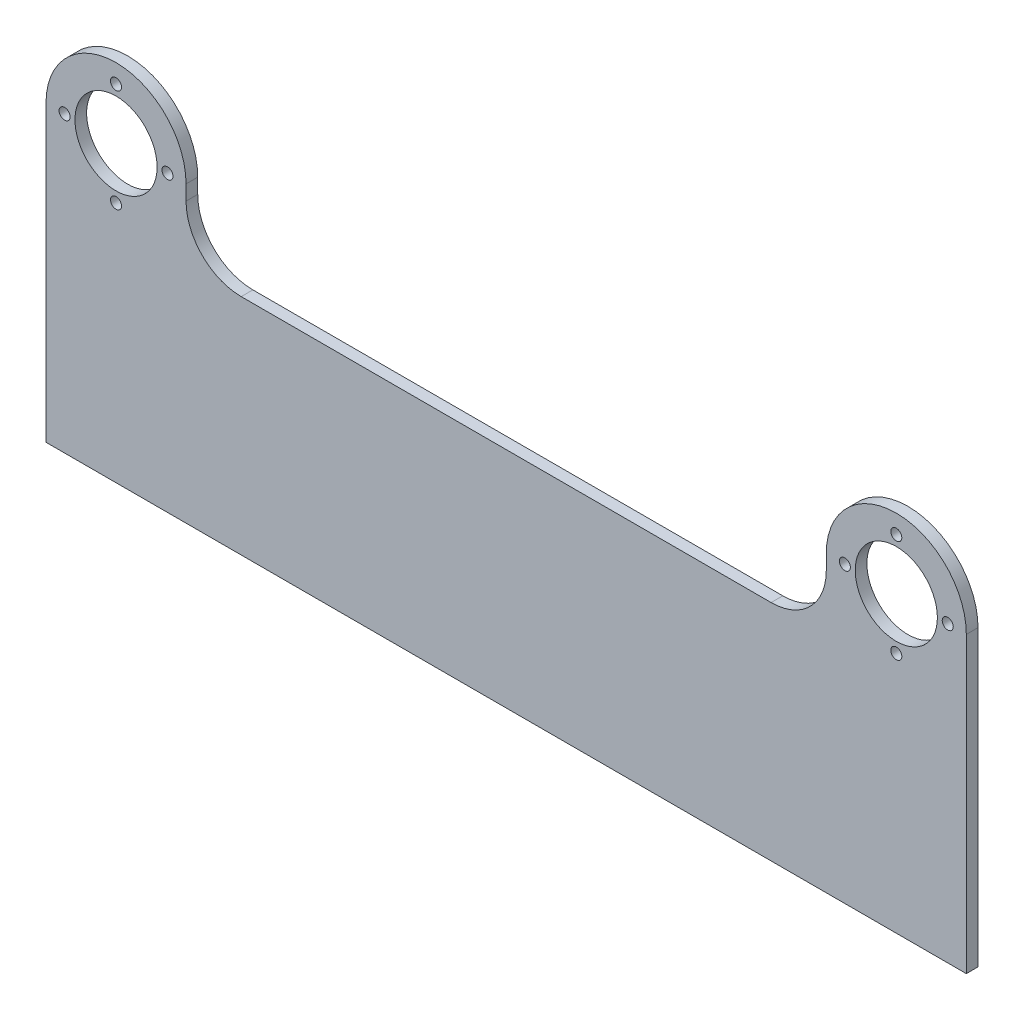
ISO-10303-21;
HEADER;
FILE_DESCRIPTION(('STEP AP214'),'2;1');
FILE_NAME('part.step','',(''),(''),'','','');
FILE_SCHEMA(('AUTOMOTIVE_DESIGN { 1 0 10303 214 1 1 1 1 }'));
ENDSEC;
DATA;
#1=APPLICATION_CONTEXT('core data for automotive mechanical design processes');
#2=APPLICATION_PROTOCOL_DEFINITION('international standard','automotive_design',2000,#1);
#3=PRODUCT_CONTEXT('',#1,'mechanical');
#4=PRODUCT('Part','Part','',(#3));
#5=PRODUCT_RELATED_PRODUCT_CATEGORY('part','',(#4));
#6=PRODUCT_DEFINITION_FORMATION('','',#4);
#7=PRODUCT_DEFINITION_CONTEXT('part definition',#1,'design');
#8=PRODUCT_DEFINITION('design','',#6,#7);
#9=PRODUCT_DEFINITION_SHAPE('','',#8);
#10=(LENGTH_UNIT() NAMED_UNIT(*) SI_UNIT(.MILLI.,.METRE.));
#11=(NAMED_UNIT(*) PLANE_ANGLE_UNIT() SI_UNIT($,.RADIAN.));
#12=(NAMED_UNIT(*) SI_UNIT($,.STERADIAN.) SOLID_ANGLE_UNIT());
#13=UNCERTAINTY_MEASURE_WITH_UNIT(LENGTH_MEASURE(1.E-05),#10,'distance_accuracy_value','');
#14=(GEOMETRIC_REPRESENTATION_CONTEXT(3) GLOBAL_UNCERTAINTY_ASSIGNED_CONTEXT((#13)) GLOBAL_UNIT_ASSIGNED_CONTEXT((#10,
#11,#12)) REPRESENTATION_CONTEXT('',''));
#15=CARTESIAN_POINT('',(0.,0.,0.));
#16=DIRECTION('',(0.,0.,1.));
#17=DIRECTION('',(1.,0.,0.));
#18=AXIS2_PLACEMENT_3D('',#15,#16,#17);
#19=CARTESIAN_POINT('',(178.2,-4.05,3.175));
#20=DIRECTION('',(0.,0.,-1.));
#21=DIRECTION('',(-1.,0.,0.));
#22=AXIS2_PLACEMENT_3D('',#19,#20,#21);
#23=PLANE('',#22);
#24=CARTESIAN_POINT('',(178.2,-4.05,3.175));
#25=DIRECTION('',(0.,0.,-1.));
#26=DIRECTION('',(-1.,0.,0.));
#27=AXIS2_PLACEMENT_3D('',#24,#25,#26);
#28=CIRCLE('',#27,15.);
#29=CARTESIAN_POINT('',(193.2,-4.0499999999999,3.175));
#30=VERTEX_POINT('',#29);
#31=CARTESIAN_POINT('',(178.2,-19.05,3.175));
#32=VERTEX_POINT('',#31);
#33=EDGE_CURVE('E183',#30,#32,#28,.T.);
#34=ORIENTED_EDGE('',*,*,#33,.T.);
#35=DIRECTION('',(-1.,0.,0.));
#36=VECTOR('',#35,1.);
#37=CARTESIAN_POINT('',(34.0500000000001,-19.05,3.175));
#38=LINE('',#37,#36);
#39=CARTESIAN_POINT('',(34.0500000000001,-19.05,3.175));
#40=VERTEX_POINT('',#39);
#41=EDGE_CURVE('E106',#32,#40,#38,.T.);
#42=ORIENTED_EDGE('',*,*,#41,.T.);
#43=CARTESIAN_POINT('',(34.05,-4.05,3.175));
#44=DIRECTION('',(0.,0.,-1.));
#45=DIRECTION('',(1.,0.,0.));
#46=AXIS2_PLACEMENT_3D('',#43,#44,#45);
#47=CIRCLE('',#46,15.);
#48=CARTESIAN_POINT('',(19.05,-4.0499999999999,3.175));
#49=VERTEX_POINT('',#48);
#50=EDGE_CURVE('E212',#40,#49,#47,.T.);
#51=ORIENTED_EDGE('',*,*,#50,.T.);
#52=DIRECTION('',(0.,1.,0.));
#53=VECTOR('',#52,1.);
#54=CARTESIAN_POINT('',(19.05,0.,3.175));
#55=LINE('',#54,#53);
#56=CARTESIAN_POINT('',(19.05,0.,3.175));
#57=VERTEX_POINT('',#56);
#58=EDGE_CURVE('E231',#49,#57,#55,.T.);
#59=ORIENTED_EDGE('',*,*,#58,.T.);
#60=CARTESIAN_POINT('',(0.,0.,3.175));
#61=DIRECTION('',(0.,0.,1.));
#62=DIRECTION('',(1.,0.,0.));
#63=AXIS2_PLACEMENT_3D('',#60,#61,#62);
#64=CIRCLE('',#63,19.05);
#65=CARTESIAN_POINT('',(-19.05,0.,3.175));
#66=VERTEX_POINT('',#65);
#67=EDGE_CURVE('E227',#57,#66,#64,.T.);
#68=ORIENTED_EDGE('',*,*,#67,.T.);
#69=DIRECTION('',(0.,-1.,0.));
#70=VECTOR('',#69,1.);
#71=CARTESIAN_POINT('',(-19.05,-19.05,3.175));
#72=LINE('',#71,#70);
#73=CARTESIAN_POINT('',(-19.05,-79.925453531839,3.175));
#74=VERTEX_POINT('',#73);
#75=EDGE_CURVE('E230',#66,#74,#72,.T.);
#76=ORIENTED_EDGE('',*,*,#75,.T.);
#77=DIRECTION('',(1.,0.,0.));
#78=VECTOR('',#77,1.);
#79=CARTESIAN_POINT('',(-19.05,-79.925453531839,3.175));
#80=LINE('',#79,#78);
#81=CARTESIAN_POINT('',(231.3,-79.925453531839,3.175));
#82=VERTEX_POINT('',#81);
#83=EDGE_CURVE('E131',#74,#82,#80,.T.);
#84=ORIENTED_EDGE('',*,*,#83,.T.);
#85=DIRECTION('',(0.,1.,0.));
#86=VECTOR('',#85,1.);
#87=CARTESIAN_POINT('',(231.3,-19.05,3.175));
#88=LINE('',#87,#86);
#89=CARTESIAN_POINT('',(231.3,0.,3.175));
#90=VERTEX_POINT('',#89);
#91=EDGE_CURVE('E125',#82,#90,#88,.T.);
#92=ORIENTED_EDGE('',*,*,#91,.T.);
#93=CARTESIAN_POINT('',(212.25,0.,3.175));
#94=DIRECTION('',(0.,0.,1.));
#95=DIRECTION('',(1.,0.,0.));
#96=AXIS2_PLACEMENT_3D('',#93,#94,#95);
#97=CIRCLE('',#96,19.05);
#98=CARTESIAN_POINT('',(193.2,0.,3.175));
#99=VERTEX_POINT('',#98);
#100=EDGE_CURVE('E129',#90,#99,#97,.T.);
#101=ORIENTED_EDGE('',*,*,#100,.T.);
#102=DIRECTION('',(0.,-1.,0.));
#103=VECTOR('',#102,1.);
#104=CARTESIAN_POINT('',(193.2,0.,3.175));
#105=LINE('',#104,#103);
#106=EDGE_CURVE('E57',#99,#30,#105,.T.);
#107=ORIENTED_EDGE('',*,*,#106,.T.);
#108=EDGE_LOOP('',(#34,#42,#51,#59,#68,#76,#84,#92,#101,#107));
#109=FACE_BOUND('',#108,.T.);
#110=CARTESIAN_POINT('',(0.,0.,3.175));
#111=DIRECTION('',(0.,0.,1.));
#112=DIRECTION('',(1.,0.,0.));
#113=AXIS2_PLACEMENT_3D('',#110,#111,#112);
#114=CIRCLE('',#113,11.176);
#115=CARTESIAN_POINT('',(11.176,0.,3.175));
#116=VERTEX_POINT('',#115);
#117=EDGE_CURVE('E157',#116,#116,#114,.T.);
#118=ORIENTED_EDGE('',*,*,#117,.F.);
#119=EDGE_LOOP('',(#118));
#120=FACE_BOUND('',#119,.T.);
#121=CARTESIAN_POINT('',(212.25,0.,3.175));
#122=DIRECTION('',(0.,0.,1.));
#123=DIRECTION('',(1.,0.,0.));
#124=AXIS2_PLACEMENT_3D('',#121,#122,#123);
#125=CIRCLE('',#124,11.176);
#126=CARTESIAN_POINT('',(223.426,0.,3.175));
#127=VERTEX_POINT('',#126);
#128=EDGE_CURVE('E249',#127,#127,#125,.T.);
#129=ORIENTED_EDGE('',*,*,#128,.F.);
#130=EDGE_LOOP('',(#129));
#131=FACE_BOUND('',#130,.T.);
#132=CARTESIAN_POINT('',(0.,13.9954,3.175));
#133=DIRECTION('',(0.,0.,1.));
#134=DIRECTION('',(1.,0.,0.));
#135=AXIS2_PLACEMENT_3D('',#132,#133,#134);
#136=CIRCLE('',#135,1.5);
#137=CARTESIAN_POINT('',(1.5,13.9954,3.175));
#138=VERTEX_POINT('',#137);
#139=EDGE_CURVE('E257',#138,#138,#136,.T.);
#140=ORIENTED_EDGE('',*,*,#139,.F.);
#141=EDGE_LOOP('',(#140));
#142=FACE_BOUND('',#141,.T.);
#143=CARTESIAN_POINT('',(212.25,13.9954,3.175));
#144=DIRECTION('',(0.,0.,1.));
#145=DIRECTION('',(1.,0.,0.));
#146=AXIS2_PLACEMENT_3D('',#143,#144,#145);
#147=CIRCLE('',#146,1.5);
#148=CARTESIAN_POINT('',(213.75,13.9954,3.175));
#149=VERTEX_POINT('',#148);
#150=EDGE_CURVE('E265',#149,#149,#147,.T.);
#151=ORIENTED_EDGE('',*,*,#150,.F.);
#152=EDGE_LOOP('',(#151));
#153=FACE_BOUND('',#152,.T.);
#154=CARTESIAN_POINT('',(13.9954,0.,3.175));
#155=DIRECTION('',(0.,0.,1.));
#156=DIRECTION('',(1.,0.,0.));
#157=AXIS2_PLACEMENT_3D('',#154,#155,#156);
#158=CIRCLE('',#157,1.50000000000005);
#159=CARTESIAN_POINT('',(15.4954000000001,0.,3.175));
#160=VERTEX_POINT('',#159);
#161=EDGE_CURVE('E273',#160,#160,#158,.T.);
#162=ORIENTED_EDGE('',*,*,#161,.F.);
#163=EDGE_LOOP('',(#162));
#164=FACE_BOUND('',#163,.T.);
#165=CARTESIAN_POINT('',(0.,-13.9954,3.175));
#166=DIRECTION('',(0.,0.,1.));
#167=DIRECTION('',(1.,0.,0.));
#168=AXIS2_PLACEMENT_3D('',#165,#166,#167);
#169=CIRCLE('',#168,1.50000000000009);
#170=CARTESIAN_POINT('',(1.5000000000001,-13.9954,3.175));
#171=VERTEX_POINT('',#170);
#172=EDGE_CURVE('E281',#171,#171,#169,.T.);
#173=ORIENTED_EDGE('',*,*,#172,.F.);
#174=EDGE_LOOP('',(#173));
#175=FACE_BOUND('',#174,.T.);
#176=CARTESIAN_POINT('',(-13.9954,0.,3.175));
#177=DIRECTION('',(0.,0.,1.));
#178=DIRECTION('',(1.,0.,0.));
#179=AXIS2_PLACEMENT_3D('',#176,#177,#178);
#180=CIRCLE('',#179,1.50000000000014);
#181=CARTESIAN_POINT('',(-12.4953999999999,0.,3.175));
#182=VERTEX_POINT('',#181);
#183=EDGE_CURVE('E289',#182,#182,#180,.T.);
#184=ORIENTED_EDGE('',*,*,#183,.F.);
#185=EDGE_LOOP('',(#184));
#186=FACE_BOUND('',#185,.T.);
#187=CARTESIAN_POINT('',(198.2546,-2.4980018054066E-13,3.175));
#188=DIRECTION('',(0.,0.,1.));
#189=DIRECTION('',(1.,0.,0.));
#190=AXIS2_PLACEMENT_3D('',#187,#188,#189);
#191=CIRCLE('',#190,1.5);
#192=CARTESIAN_POINT('',(199.7546,-2.4980018054066E-13,3.175));
#193=VERTEX_POINT('',#192);
#194=EDGE_CURVE('E297',#193,#193,#191,.T.);
#195=ORIENTED_EDGE('',*,*,#194,.F.);
#196=EDGE_LOOP('',(#195));
#197=FACE_BOUND('',#196,.T.);
#198=CARTESIAN_POINT('',(212.25,-13.9954,3.175));
#199=DIRECTION('',(0.,0.,1.));
#200=DIRECTION('',(1.,0.,0.));
#201=AXIS2_PLACEMENT_3D('',#198,#199,#200);
#202=CIRCLE('',#201,1.5);
#203=CARTESIAN_POINT('',(213.75,-13.9954,3.175));
#204=VERTEX_POINT('',#203);
#205=EDGE_CURVE('E305',#204,#204,#202,.T.);
#206=ORIENTED_EDGE('',*,*,#205,.F.);
#207=EDGE_LOOP('',(#206));
#208=FACE_BOUND('',#207,.T.);
#209=CARTESIAN_POINT('',(226.2454,3.33066907387547E-13,3.175));
#210=DIRECTION('',(0.,0.,1.));
#211=DIRECTION('',(1.,0.,0.));
#212=AXIS2_PLACEMENT_3D('',#209,#210,#211);
#213=CIRCLE('',#212,1.50000000000001);
#214=CARTESIAN_POINT('',(227.7454,3.33066907387547E-13,3.175));
#215=VERTEX_POINT('',#214);
#216=EDGE_CURVE('E313',#215,#215,#213,.T.);
#217=ORIENTED_EDGE('',*,*,#216,.F.);
#218=EDGE_LOOP('',(#217));
#219=FACE_BOUND('',#218,.T.);
#220=ADVANCED_FACE('F39',(#109,#120,#131,#142,#153,#164,#175,#186,#197,#208,#219),#23,.F.);
#221=CARTESIAN_POINT('',(178.2,-4.05,0.));
#222=DIRECTION('',(0.,0.,-1.));
#223=DIRECTION('',(-1.,0.,0.));
#224=AXIS2_PLACEMENT_3D('',#221,#222,#223);
#225=PLANE('',#224);
#226=CARTESIAN_POINT('',(212.25,-13.9954,0.));
#227=DIRECTION('',(0.,0.,1.));
#228=DIRECTION('',(1.,0.,0.));
#229=AXIS2_PLACEMENT_3D('',#226,#227,#228);
#230=CIRCLE('',#229,1.5);
#231=CARTESIAN_POINT('',(213.75,-13.9954,0.));
#232=VERTEX_POINT('',#231);
#233=EDGE_CURVE('E309',#232,#232,#230,.T.);
#234=ORIENTED_EDGE('',*,*,#233,.T.);
#235=EDGE_LOOP('',(#234));
#236=FACE_BOUND('',#235,.T.);
#237=CARTESIAN_POINT('',(-13.9954,0.,0.));
#238=DIRECTION('',(0.,0.,1.));
#239=DIRECTION('',(1.,0.,0.));
#240=AXIS2_PLACEMENT_3D('',#237,#238,#239);
#241=CIRCLE('',#240,1.50000000000014);
#242=CARTESIAN_POINT('',(-12.4953999999999,0.,0.));
#243=VERTEX_POINT('',#242);
#244=EDGE_CURVE('E293',#243,#243,#241,.T.);
#245=ORIENTED_EDGE('',*,*,#244,.T.);
#246=EDGE_LOOP('',(#245));
#247=FACE_BOUND('',#246,.T.);
#248=CARTESIAN_POINT('',(13.9954,0.,0.));
#249=DIRECTION('',(0.,0.,1.));
#250=DIRECTION('',(1.,0.,0.));
#251=AXIS2_PLACEMENT_3D('',#248,#249,#250);
#252=CIRCLE('',#251,1.50000000000005);
#253=CARTESIAN_POINT('',(15.4954000000001,0.,0.));
#254=VERTEX_POINT('',#253);
#255=EDGE_CURVE('E277',#254,#254,#252,.T.);
#256=ORIENTED_EDGE('',*,*,#255,.T.);
#257=EDGE_LOOP('',(#256));
#258=FACE_BOUND('',#257,.T.);
#259=CARTESIAN_POINT('',(0.,13.9954,0.));
#260=DIRECTION('',(0.,0.,1.));
#261=DIRECTION('',(1.,0.,0.));
#262=AXIS2_PLACEMENT_3D('',#259,#260,#261);
#263=CIRCLE('',#262,1.5);
#264=CARTESIAN_POINT('',(1.5,13.9954,0.));
#265=VERTEX_POINT('',#264);
#266=EDGE_CURVE('E261',#265,#265,#263,.T.);
#267=ORIENTED_EDGE('',*,*,#266,.T.);
#268=EDGE_LOOP('',(#267));
#269=FACE_BOUND('',#268,.T.);
#270=CARTESIAN_POINT('',(0.,0.,0.));
#271=DIRECTION('',(0.,0.,1.));
#272=DIRECTION('',(1.,0.,0.));
#273=AXIS2_PLACEMENT_3D('',#270,#271,#272);
#274=CIRCLE('',#273,11.176);
#275=CARTESIAN_POINT('',(11.176,0.,0.));
#276=VERTEX_POINT('',#275);
#277=EDGE_CURVE('E245',#276,#276,#274,.T.);
#278=ORIENTED_EDGE('',*,*,#277,.T.);
#279=EDGE_LOOP('',(#278));
#280=FACE_BOUND('',#279,.T.);
#281=CARTESIAN_POINT('',(178.2,-4.05,0.));
#282=DIRECTION('',(0.,0.,-1.));
#283=DIRECTION('',(-1.,0.,0.));
#284=AXIS2_PLACEMENT_3D('',#281,#282,#283);
#285=CIRCLE('',#284,15.);
#286=CARTESIAN_POINT('',(193.2,-4.0499999999999,0.));
#287=VERTEX_POINT('',#286);
#288=CARTESIAN_POINT('',(178.2,-19.05,0.));
#289=VERTEX_POINT('',#288);
#290=EDGE_CURVE('E152',#287,#289,#285,.T.);
#291=ORIENTED_EDGE('',*,*,#290,.F.);
#292=DIRECTION('',(0.,-1.,0.));
#293=VECTOR('',#292,1.);
#294=CARTESIAN_POINT('',(193.2,0.,0.));
#295=LINE('',#294,#293);
#296=CARTESIAN_POINT('',(193.2,0.,0.));
#297=VERTEX_POINT('',#296);
#298=EDGE_CURVE('E98',#297,#287,#295,.T.);
#299=ORIENTED_EDGE('',*,*,#298,.F.);
#300=CARTESIAN_POINT('',(212.25,0.,0.));
#301=DIRECTION('',(0.,0.,1.));
#302=DIRECTION('',(1.,0.,0.));
#303=AXIS2_PLACEMENT_3D('',#300,#301,#302);
#304=CIRCLE('',#303,19.05);
#305=CARTESIAN_POINT('',(231.3,0.,0.));
#306=VERTEX_POINT('',#305);
#307=EDGE_CURVE('E92',#306,#297,#304,.T.);
#308=ORIENTED_EDGE('',*,*,#307,.F.);
#309=DIRECTION('',(0.,1.,0.));
#310=VECTOR('',#309,1.);
#311=CARTESIAN_POINT('',(231.3,0.,0.));
#312=LINE('',#311,#310);
#313=CARTESIAN_POINT('',(231.3,-79.925453531839,0.));
#314=VERTEX_POINT('',#313);
#315=EDGE_CURVE('E139',#314,#306,#312,.T.);
#316=ORIENTED_EDGE('',*,*,#315,.F.);
#317=DIRECTION('',(1.,0.,0.));
#318=VECTOR('',#317,1.);
#319=CARTESIAN_POINT('',(-19.05,-79.925453531839,0.));
#320=LINE('',#319,#318);
#321=CARTESIAN_POINT('',(-19.05,-79.925453531839,0.));
#322=VERTEX_POINT('',#321);
#323=EDGE_CURVE('E173',#322,#314,#320,.T.);
#324=ORIENTED_EDGE('',*,*,#323,.F.);
#325=DIRECTION('',(0.,-1.,0.));
#326=VECTOR('',#325,1.);
#327=CARTESIAN_POINT('',(-19.05,-19.05,0.));
#328=LINE('',#327,#326);
#329=CARTESIAN_POINT('',(-19.05,0.,0.));
#330=VERTEX_POINT('',#329);
#331=EDGE_CURVE('E170',#330,#322,#328,.T.);
#332=ORIENTED_EDGE('',*,*,#331,.F.);
#333=CARTESIAN_POINT('',(0.,0.,0.));
#334=DIRECTION('',(0.,0.,1.));
#335=DIRECTION('',(1.,0.,0.));
#336=AXIS2_PLACEMENT_3D('',#333,#334,#335);
#337=CIRCLE('',#336,19.05);
#338=CARTESIAN_POINT('',(19.05,0.,0.));
#339=VERTEX_POINT('',#338);
#340=EDGE_CURVE('E166',#339,#330,#337,.T.);
#341=ORIENTED_EDGE('',*,*,#340,.F.);
#342=DIRECTION('',(0.,1.,0.));
#343=VECTOR('',#342,1.);
#344=CARTESIAN_POINT('',(19.05,0.,0.));
#345=LINE('',#344,#343);
#346=CARTESIAN_POINT('',(19.05,-4.0499999999999,0.));
#347=VERTEX_POINT('',#346);
#348=EDGE_CURVE('E163',#347,#339,#345,.T.);
#349=ORIENTED_EDGE('',*,*,#348,.F.);
#350=CARTESIAN_POINT('',(34.05,-4.05,0.));
#351=DIRECTION('',(0.,0.,-1.));
#352=DIRECTION('',(1.,0.,0.));
#353=AXIS2_PLACEMENT_3D('',#350,#351,#352);
#354=CIRCLE('',#353,15.);
#355=CARTESIAN_POINT('',(34.0500000000001,-19.05,0.));
#356=VERTEX_POINT('',#355);
#357=EDGE_CURVE('E160',#356,#347,#354,.T.);
#358=ORIENTED_EDGE('',*,*,#357,.F.);
#359=DIRECTION('',(-1.,0.,0.));
#360=VECTOR('',#359,1.);
#361=CARTESIAN_POINT('',(34.0500000000001,-19.05,0.));
#362=LINE('',#361,#360);
#363=EDGE_CURVE('E156',#289,#356,#362,.T.);
#364=ORIENTED_EDGE('',*,*,#363,.F.);
#365=EDGE_LOOP('',(#291,#299,#308,#316,#324,#332,#341,#349,#358,#364));
#366=FACE_BOUND('',#365,.T.);
#367=CARTESIAN_POINT('',(212.25,0.,0.));
#368=DIRECTION('',(0.,0.,1.));
#369=DIRECTION('',(1.,0.,0.));
#370=AXIS2_PLACEMENT_3D('',#367,#368,#369);
#371=CIRCLE('',#370,11.176);
#372=CARTESIAN_POINT('',(223.426,0.,0.));
#373=VERTEX_POINT('',#372);
#374=EDGE_CURVE('E253',#373,#373,#371,.T.);
#375=ORIENTED_EDGE('',*,*,#374,.T.);
#376=EDGE_LOOP('',(#375));
#377=FACE_BOUND('',#376,.T.);
#378=CARTESIAN_POINT('',(212.25,13.9954,0.));
#379=DIRECTION('',(0.,0.,1.));
#380=DIRECTION('',(1.,0.,0.));
#381=AXIS2_PLACEMENT_3D('',#378,#379,#380);
#382=CIRCLE('',#381,1.5);
#383=CARTESIAN_POINT('',(213.75,13.9954,0.));
#384=VERTEX_POINT('',#383);
#385=EDGE_CURVE('E269',#384,#384,#382,.T.);
#386=ORIENTED_EDGE('',*,*,#385,.T.);
#387=EDGE_LOOP('',(#386));
#388=FACE_BOUND('',#387,.T.);
#389=CARTESIAN_POINT('',(0.,-13.9954,0.));
#390=DIRECTION('',(0.,0.,1.));
#391=DIRECTION('',(1.,0.,0.));
#392=AXIS2_PLACEMENT_3D('',#389,#390,#391);
#393=CIRCLE('',#392,1.50000000000009);
#394=CARTESIAN_POINT('',(1.5000000000001,-13.9954,0.));
#395=VERTEX_POINT('',#394);
#396=EDGE_CURVE('E285',#395,#395,#393,.T.);
#397=ORIENTED_EDGE('',*,*,#396,.T.);
#398=EDGE_LOOP('',(#397));
#399=FACE_BOUND('',#398,.T.);
#400=CARTESIAN_POINT('',(198.2546,-2.4980018054066E-13,0.));
#401=DIRECTION('',(0.,0.,1.));
#402=DIRECTION('',(1.,0.,0.));
#403=AXIS2_PLACEMENT_3D('',#400,#401,#402);
#404=CIRCLE('',#403,1.5);
#405=CARTESIAN_POINT('',(199.7546,-2.4980018054066E-13,0.));
#406=VERTEX_POINT('',#405);
#407=EDGE_CURVE('E301',#406,#406,#404,.T.);
#408=ORIENTED_EDGE('',*,*,#407,.T.);
#409=EDGE_LOOP('',(#408));
#410=FACE_BOUND('',#409,.T.);
#411=CARTESIAN_POINT('',(226.2454,3.33066907387547E-13,0.));
#412=DIRECTION('',(0.,0.,1.));
#413=DIRECTION('',(1.,0.,0.));
#414=AXIS2_PLACEMENT_3D('',#411,#412,#413);
#415=CIRCLE('',#414,1.50000000000001);
#416=CARTESIAN_POINT('',(227.7454,3.33066907387547E-13,0.));
#417=VERTEX_POINT('',#416);
#418=EDGE_CURVE('E317',#417,#417,#415,.T.);
#419=ORIENTED_EDGE('',*,*,#418,.T.);
#420=EDGE_LOOP('',(#419));
#421=FACE_BOUND('',#420,.T.);
#422=ADVANCED_FACE('F216',(#236,#247,#258,#269,#280,#366,#377,#388,#399,#410,#421),#225,.T.);
#423=CARTESIAN_POINT('',(178.2,-4.05,3.175));
#424=DIRECTION('',(0.,0.,-1.));
#425=DIRECTION('',(-1.,0.,0.));
#426=AXIS2_PLACEMENT_3D('',#423,#424,#425);
#427=CYLINDRICAL_SURFACE('',#426,15.);
#428=ORIENTED_EDGE('',*,*,#290,.T.);
#429=DIRECTION('',(0.,0.,-1.));
#430=VECTOR('',#429,1.);
#431=CARTESIAN_POINT('',(178.2,-19.05,3.175));
#432=LINE('',#431,#430);
#433=EDGE_CURVE('E11',#32,#289,#432,.T.);
#434=ORIENTED_EDGE('',*,*,#433,.F.);
#435=ORIENTED_EDGE('',*,*,#33,.F.);
#436=DIRECTION('',(0.,0.,-1.));
#437=VECTOR('',#436,1.);
#438=CARTESIAN_POINT('',(193.2,-4.0499999999999,3.175));
#439=LINE('',#438,#437);
#440=EDGE_CURVE('E148',#30,#287,#439,.T.);
#441=ORIENTED_EDGE('',*,*,#440,.T.);
#442=EDGE_LOOP('',(#428,#434,#435,#441));
#443=FACE_BOUND('',#442,.T.);
#444=ADVANCED_FACE('F41',(#443),#427,.F.);
#445=CARTESIAN_POINT('',(34.0500000000001,-19.05,3.175));
#446=DIRECTION('',(0.,-1.,0.));
#447=DIRECTION('',(0.,0.,-1.));
#448=AXIS2_PLACEMENT_3D('',#445,#446,#447);
#449=PLANE('',#448);
#450=ORIENTED_EDGE('',*,*,#363,.T.);
#451=DIRECTION('',(0.,0.,-1.));
#452=VECTOR('',#451,1.);
#453=CARTESIAN_POINT('',(34.0500000000001,-19.05,3.175));
#454=LINE('',#453,#452);
#455=EDGE_CURVE('E49',#40,#356,#454,.T.);
#456=ORIENTED_EDGE('',*,*,#455,.F.);
#457=ORIENTED_EDGE('',*,*,#41,.F.);
#458=ORIENTED_EDGE('',*,*,#433,.T.);
#459=EDGE_LOOP('',(#450,#456,#457,#458));
#460=FACE_BOUND('',#459,.T.);
#461=ADVANCED_FACE('F359',(#460),#449,.F.);
#462=CARTESIAN_POINT('',(34.05,-4.05,3.175));
#463=DIRECTION('',(0.,0.,-1.));
#464=DIRECTION('',(-1.,0.,0.));
#465=AXIS2_PLACEMENT_3D('',#462,#463,#464);
#466=CYLINDRICAL_SURFACE('',#465,15.);
#467=ORIENTED_EDGE('',*,*,#357,.T.);
#468=DIRECTION('',(0.,0.,-1.));
#469=VECTOR('',#468,1.);
#470=CARTESIAN_POINT('',(19.05,-4.0499999999999,3.175));
#471=LINE('',#470,#469);
#472=EDGE_CURVE('E202',#49,#347,#471,.T.);
#473=ORIENTED_EDGE('',*,*,#472,.F.);
#474=ORIENTED_EDGE('',*,*,#50,.F.);
#475=ORIENTED_EDGE('',*,*,#455,.T.);
#476=EDGE_LOOP('',(#467,#473,#474,#475));
#477=FACE_BOUND('',#476,.T.);
#478=ADVANCED_FACE('F210',(#477),#466,.F.);
#479=CARTESIAN_POINT('',(19.05,0.,3.175));
#480=DIRECTION('',(-1.,0.,0.));
#481=DIRECTION('',(0.,0.,1.));
#482=AXIS2_PLACEMENT_3D('',#479,#480,#481);
#483=PLANE('',#482);
#484=ORIENTED_EDGE('',*,*,#348,.T.);
#485=DIRECTION('',(0.,0.,-1.));
#486=VECTOR('',#485,1.);
#487=CARTESIAN_POINT('',(19.05,0.,3.175));
#488=LINE('',#487,#486);
#489=EDGE_CURVE('E198',#57,#339,#488,.T.);
#490=ORIENTED_EDGE('',*,*,#489,.F.);
#491=ORIENTED_EDGE('',*,*,#58,.F.);
#492=ORIENTED_EDGE('',*,*,#472,.T.);
#493=EDGE_LOOP('',(#484,#490,#491,#492));
#494=FACE_BOUND('',#493,.T.);
#495=ADVANCED_FACE('F221',(#494),#483,.F.);
#496=CARTESIAN_POINT('',(0.,0.,3.175));
#497=DIRECTION('',(0.,0.,-1.));
#498=DIRECTION('',(-1.,0.,0.));
#499=AXIS2_PLACEMENT_3D('',#496,#497,#498);
#500=CYLINDRICAL_SURFACE('',#499,19.05);
#501=ORIENTED_EDGE('',*,*,#340,.T.);
#502=DIRECTION('',(0.,0.,-1.));
#503=VECTOR('',#502,1.);
#504=CARTESIAN_POINT('',(-19.05,0.,3.175));
#505=LINE('',#504,#503);
#506=EDGE_CURVE('E194',#66,#330,#505,.T.);
#507=ORIENTED_EDGE('',*,*,#506,.F.);
#508=ORIENTED_EDGE('',*,*,#67,.F.);
#509=ORIENTED_EDGE('',*,*,#489,.T.);
#510=EDGE_LOOP('',(#501,#507,#508,#509));
#511=FACE_BOUND('',#510,.T.);
#512=ADVANCED_FACE('F225',(#511),#500,.T.);
#513=CARTESIAN_POINT('',(-19.05,-19.05,3.175));
#514=DIRECTION('',(1.,0.,0.));
#515=DIRECTION('',(0.,0.,-1.));
#516=AXIS2_PLACEMENT_3D('',#513,#514,#515);
#517=PLANE('',#516);
#518=ORIENTED_EDGE('',*,*,#331,.T.);
#519=DIRECTION('',(0.,0.,-1.));
#520=VECTOR('',#519,1.);
#521=CARTESIAN_POINT('',(-19.05,-79.925453531839,3.175));
#522=LINE('',#521,#520);
#523=EDGE_CURVE('E190',#74,#322,#522,.T.);
#524=ORIENTED_EDGE('',*,*,#523,.F.);
#525=ORIENTED_EDGE('',*,*,#75,.F.);
#526=ORIENTED_EDGE('',*,*,#506,.T.);
#527=EDGE_LOOP('',(#518,#524,#525,#526));
#528=FACE_BOUND('',#527,.T.);
#529=ADVANCED_FACE('F349',(#528),#517,.F.);
#530=CARTESIAN_POINT('',(-19.05,-79.925453531839,3.175));
#531=DIRECTION('',(0.,1.,0.));
#532=DIRECTION('',(0.,0.,1.));
#533=AXIS2_PLACEMENT_3D('',#530,#531,#532);
#534=PLANE('',#533);
#535=ORIENTED_EDGE('',*,*,#323,.T.);
#536=DIRECTION('',(0.,0.,-1.));
#537=VECTOR('',#536,1.);
#538=CARTESIAN_POINT('',(231.3,-79.925453531839,3.175));
#539=LINE('',#538,#537);
#540=EDGE_CURVE('E141',#82,#314,#539,.T.);
#541=ORIENTED_EDGE('',*,*,#540,.F.);
#542=ORIENTED_EDGE('',*,*,#83,.F.);
#543=ORIENTED_EDGE('',*,*,#523,.T.);
#544=EDGE_LOOP('',(#535,#541,#542,#543));
#545=FACE_BOUND('',#544,.T.);
#546=ADVANCED_FACE('F346',(#545),#534,.F.);
#547=CARTESIAN_POINT('',(231.3,0.,3.175));
#548=DIRECTION('',(-1.,0.,0.));
#549=DIRECTION('',(0.,0.,1.));
#550=AXIS2_PLACEMENT_3D('',#547,#548,#549);
#551=PLANE('',#550);
#552=ORIENTED_EDGE('',*,*,#315,.T.);
#553=DIRECTION('',(0.,0.,-1.));
#554=VECTOR('',#553,1.);
#555=CARTESIAN_POINT('',(231.3,0.,3.175));
#556=LINE('',#555,#554);
#557=EDGE_CURVE('E137',#90,#306,#556,.T.);
#558=ORIENTED_EDGE('',*,*,#557,.F.);
#559=ORIENTED_EDGE('',*,*,#91,.F.);
#560=ORIENTED_EDGE('',*,*,#540,.T.);
#561=EDGE_LOOP('',(#552,#558,#559,#560));
#562=FACE_BOUND('',#561,.T.);
#563=ADVANCED_FACE('F138',(#562),#551,.F.);
#564=CARTESIAN_POINT('',(212.25,0.,3.175));
#565=DIRECTION('',(0.,0.,-1.));
#566=DIRECTION('',(-1.,0.,0.));
#567=AXIS2_PLACEMENT_3D('',#564,#565,#566);
#568=CYLINDRICAL_SURFACE('',#567,19.05);
#569=ORIENTED_EDGE('',*,*,#307,.T.);
#570=DIRECTION('',(0.,0.,-1.));
#571=VECTOR('',#570,1.);
#572=CARTESIAN_POINT('',(193.2,0.,3.175));
#573=LINE('',#572,#571);
#574=EDGE_CURVE('E142',#99,#297,#573,.T.);
#575=ORIENTED_EDGE('',*,*,#574,.F.);
#576=ORIENTED_EDGE('',*,*,#100,.F.);
#577=ORIENTED_EDGE('',*,*,#557,.T.);
#578=EDGE_LOOP('',(#569,#575,#576,#577));
#579=FACE_BOUND('',#578,.T.);
#580=ADVANCED_FACE('F144',(#579),#568,.T.);
#581=CARTESIAN_POINT('',(193.2,0.,3.175));
#582=DIRECTION('',(1.,0.,0.));
#583=DIRECTION('',(0.,0.,-1.));
#584=AXIS2_PLACEMENT_3D('',#581,#582,#583);
#585=PLANE('',#584);
#586=ORIENTED_EDGE('',*,*,#298,.T.);
#587=ORIENTED_EDGE('',*,*,#440,.F.);
#588=ORIENTED_EDGE('',*,*,#106,.F.);
#589=ORIENTED_EDGE('',*,*,#574,.T.);
#590=EDGE_LOOP('',(#586,#587,#588,#589));
#591=FACE_BOUND('',#590,.T.);
#592=ADVANCED_FACE('F339',(#591),#585,.F.);
#593=CARTESIAN_POINT('',(0.,0.,3.175));
#594=DIRECTION('',(0.,0.,-1.));
#595=DIRECTION('',(-1.,0.,0.));
#596=AXIS2_PLACEMENT_3D('',#593,#594,#595);
#597=CYLINDRICAL_SURFACE('',#596,11.176);
#598=ORIENTED_EDGE('',*,*,#117,.T.);
#599=EDGE_LOOP('',(#598));
#600=FACE_BOUND('',#599,.T.);
#601=ORIENTED_EDGE('',*,*,#277,.F.);
#602=EDGE_LOOP('',(#601));
#603=FACE_BOUND('',#602,.T.);
#604=ADVANCED_FACE('F336',(#600,#603),#597,.F.);
#605=CARTESIAN_POINT('',(212.25,0.,3.175));
#606=DIRECTION('',(0.,0.,-1.));
#607=DIRECTION('',(-1.,0.,0.));
#608=AXIS2_PLACEMENT_3D('',#605,#606,#607);
#609=CYLINDRICAL_SURFACE('',#608,11.176);
#610=ORIENTED_EDGE('',*,*,#128,.T.);
#611=EDGE_LOOP('',(#610));
#612=FACE_BOUND('',#611,.T.);
#613=ORIENTED_EDGE('',*,*,#374,.F.);
#614=EDGE_LOOP('',(#613));
#615=FACE_BOUND('',#614,.T.);
#616=ADVANCED_FACE('F441',(#612,#615),#609,.F.);
#617=CARTESIAN_POINT('',(0.,13.9954,3.175));
#618=DIRECTION('',(0.,0.,-1.));
#619=DIRECTION('',(-1.,0.,0.));
#620=AXIS2_PLACEMENT_3D('',#617,#618,#619);
#621=CYLINDRICAL_SURFACE('',#620,1.5);
#622=ORIENTED_EDGE('',*,*,#139,.T.);
#623=EDGE_LOOP('',(#622));
#624=FACE_BOUND('',#623,.T.);
#625=ORIENTED_EDGE('',*,*,#266,.F.);
#626=EDGE_LOOP('',(#625));
#627=FACE_BOUND('',#626,.T.);
#628=ADVANCED_FACE('F449',(#624,#627),#621,.F.);
#629=CARTESIAN_POINT('',(212.25,13.9954,3.175));
#630=DIRECTION('',(0.,0.,-1.));
#631=DIRECTION('',(-1.,0.,0.));
#632=AXIS2_PLACEMENT_3D('',#629,#630,#631);
#633=CYLINDRICAL_SURFACE('',#632,1.5);
#634=ORIENTED_EDGE('',*,*,#150,.T.);
#635=EDGE_LOOP('',(#634));
#636=FACE_BOUND('',#635,.T.);
#637=ORIENTED_EDGE('',*,*,#385,.F.);
#638=EDGE_LOOP('',(#637));
#639=FACE_BOUND('',#638,.T.);
#640=ADVANCED_FACE('F457',(#636,#639),#633,.F.);
#641=CARTESIAN_POINT('',(13.9954,0.,3.175));
#642=DIRECTION('',(0.,0.,-1.));
#643=DIRECTION('',(-1.,0.,0.));
#644=AXIS2_PLACEMENT_3D('',#641,#642,#643);
#645=CYLINDRICAL_SURFACE('',#644,1.50000000000005);
#646=ORIENTED_EDGE('',*,*,#161,.T.);
#647=EDGE_LOOP('',(#646));
#648=FACE_BOUND('',#647,.T.);
#649=ORIENTED_EDGE('',*,*,#255,.F.);
#650=EDGE_LOOP('',(#649));
#651=FACE_BOUND('',#650,.T.);
#652=ADVANCED_FACE('F466',(#648,#651),#645,.F.);
#653=CARTESIAN_POINT('',(0.,-13.9954,3.175));
#654=DIRECTION('',(0.,0.,-1.));
#655=DIRECTION('',(-1.,0.,0.));
#656=AXIS2_PLACEMENT_3D('',#653,#654,#655);
#657=CYLINDRICAL_SURFACE('',#656,1.50000000000009);
#658=ORIENTED_EDGE('',*,*,#172,.T.);
#659=EDGE_LOOP('',(#658));
#660=FACE_BOUND('',#659,.T.);
#661=ORIENTED_EDGE('',*,*,#396,.F.);
#662=EDGE_LOOP('',(#661));
#663=FACE_BOUND('',#662,.T.);
#664=ADVANCED_FACE('F475',(#660,#663),#657,.F.);
#665=CARTESIAN_POINT('',(-13.9954,0.,3.175));
#666=DIRECTION('',(0.,0.,-1.));
#667=DIRECTION('',(-1.,0.,0.));
#668=AXIS2_PLACEMENT_3D('',#665,#666,#667);
#669=CYLINDRICAL_SURFACE('',#668,1.50000000000014);
#670=ORIENTED_EDGE('',*,*,#183,.T.);
#671=EDGE_LOOP('',(#670));
#672=FACE_BOUND('',#671,.T.);
#673=ORIENTED_EDGE('',*,*,#244,.F.);
#674=EDGE_LOOP('',(#673));
#675=FACE_BOUND('',#674,.T.);
#676=ADVANCED_FACE('F484',(#672,#675),#669,.F.);
#677=CARTESIAN_POINT('',(198.2546,-2.4980018054066E-13,3.175));
#678=DIRECTION('',(0.,0.,-1.));
#679=DIRECTION('',(-1.,0.,0.));
#680=AXIS2_PLACEMENT_3D('',#677,#678,#679);
#681=CYLINDRICAL_SURFACE('',#680,1.5);
#682=ORIENTED_EDGE('',*,*,#194,.T.);
#683=EDGE_LOOP('',(#682));
#684=FACE_BOUND('',#683,.T.);
#685=ORIENTED_EDGE('',*,*,#407,.F.);
#686=EDGE_LOOP('',(#685));
#687=FACE_BOUND('',#686,.T.);
#688=ADVANCED_FACE('F493',(#684,#687),#681,.F.);
#689=CARTESIAN_POINT('',(212.25,-13.9954,3.175));
#690=DIRECTION('',(0.,0.,-1.));
#691=DIRECTION('',(-1.,0.,0.));
#692=AXIS2_PLACEMENT_3D('',#689,#690,#691);
#693=CYLINDRICAL_SURFACE('',#692,1.5);
#694=ORIENTED_EDGE('',*,*,#205,.T.);
#695=EDGE_LOOP('',(#694));
#696=FACE_BOUND('',#695,.T.);
#697=ORIENTED_EDGE('',*,*,#233,.F.);
#698=EDGE_LOOP('',(#697));
#699=FACE_BOUND('',#698,.T.);
#700=ADVANCED_FACE('F502',(#696,#699),#693,.F.);
#701=CARTESIAN_POINT('',(226.2454,3.33066907387547E-13,3.175));
#702=DIRECTION('',(0.,0.,-1.));
#703=DIRECTION('',(-1.,0.,0.));
#704=AXIS2_PLACEMENT_3D('',#701,#702,#703);
#705=CYLINDRICAL_SURFACE('',#704,1.50000000000001);
#706=ORIENTED_EDGE('',*,*,#216,.T.);
#707=EDGE_LOOP('',(#706));
#708=FACE_BOUND('',#707,.T.);
#709=ORIENTED_EDGE('',*,*,#418,.F.);
#710=EDGE_LOOP('',(#709));
#711=FACE_BOUND('',#710,.T.);
#712=ADVANCED_FACE('F325',(#708,#711),#705,.F.);
#713=CLOSED_SHELL('',(#220,#422,#444,#461,#478,#495,#512,#529,#546,#563,#580,#592,#604,#616,
#628,#640,#652,#664,#676,#688,#700,#712));
#714=MANIFOLD_SOLID_BREP('B2',#713);
#715=ADVANCED_BREP_SHAPE_REPRESENTATION('',(#18,#714),#14);
#716=SHAPE_DEFINITION_REPRESENTATION(#9,#715);
ENDSEC;
END-ISO-10303-21;
